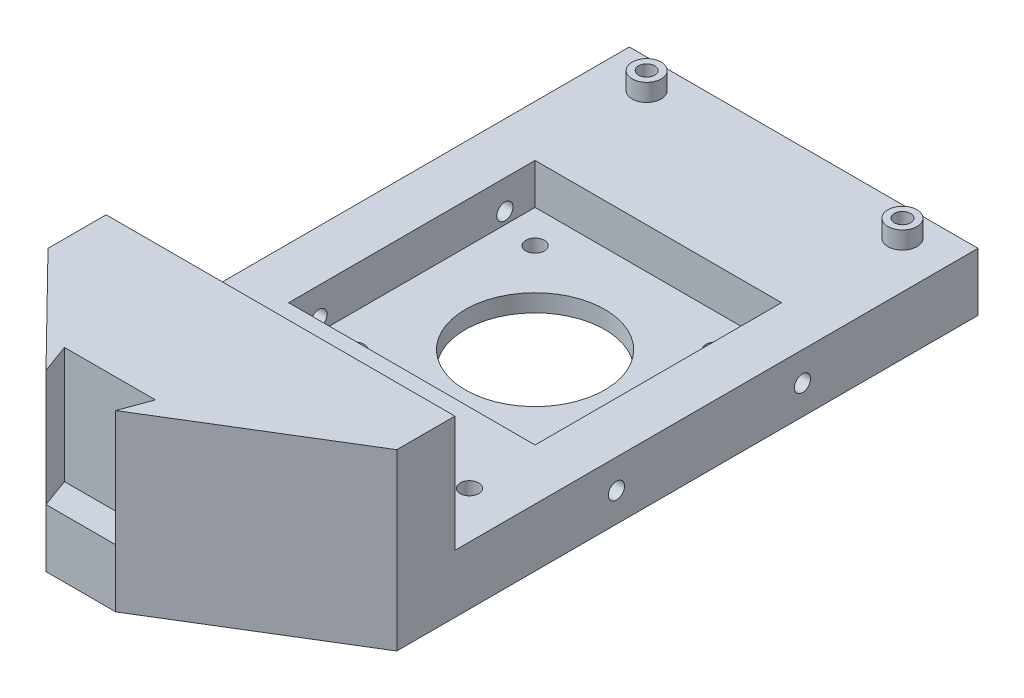
ISO-10303-21;
HEADER;
FILE_DESCRIPTION(('STEP AP214'),'2;1');
FILE_NAME('part.step','',(''),(''),'','','');
FILE_SCHEMA(('AUTOMOTIVE_DESIGN { 1 0 10303 214 1 1 1 1 }'));
ENDSEC;
DATA;
#1=APPLICATION_CONTEXT('core data for automotive mechanical design processes');
#2=APPLICATION_PROTOCOL_DEFINITION('international standard','automotive_design',2000,#1);
#3=PRODUCT_CONTEXT('',#1,'mechanical');
#4=PRODUCT('Part','Part','',(#3));
#5=PRODUCT_RELATED_PRODUCT_CATEGORY('part','',(#4));
#6=PRODUCT_DEFINITION_FORMATION('','',#4);
#7=PRODUCT_DEFINITION_CONTEXT('part definition',#1,'design');
#8=PRODUCT_DEFINITION('design','',#6,#7);
#9=PRODUCT_DEFINITION_SHAPE('','',#8);
#10=(LENGTH_UNIT() NAMED_UNIT(*) SI_UNIT(.MILLI.,.METRE.));
#11=(NAMED_UNIT(*) PLANE_ANGLE_UNIT() SI_UNIT($,.RADIAN.));
#12=(NAMED_UNIT(*) SI_UNIT($,.STERADIAN.) SOLID_ANGLE_UNIT());
#13=UNCERTAINTY_MEASURE_WITH_UNIT(LENGTH_MEASURE(1.E-05),#10,'distance_accuracy_value','');
#14=(GEOMETRIC_REPRESENTATION_CONTEXT(3) GLOBAL_UNCERTAINTY_ASSIGNED_CONTEXT((#13)) GLOBAL_UNIT_ASSIGNED_CONTEXT((#10,
#11,#12)) REPRESENTATION_CONTEXT('',''));
#15=CARTESIAN_POINT('',(0.,0.,0.));
#16=DIRECTION('',(0.,0.,1.));
#17=DIRECTION('',(1.,0.,0.));
#18=AXIS2_PLACEMENT_3D('',#15,#16,#17);
#19=CARTESIAN_POINT('',(4.65691364491559,0.,1.69497795029741));
#20=DIRECTION('',(-0.939692620785908,0.,-0.342020143325671));
#21=DIRECTION('',(-0.342020143325671,0.,0.939692620785908));
#22=AXIS2_PLACEMENT_3D('',#19,#20,#21);
#23=PLANE('',#22);
#24=DIRECTION('',(0.,1.,0.));
#25=VECTOR('',#24,1.);
#26=CARTESIAN_POINT('',(-21.9393136472184,0.,74.7675118781179));
#27=LINE('',#26,#25);
#28=CARTESIAN_POINT('',(-21.9393136472184,10.,74.7675118781179));
#29=VERTEX_POINT('',#28);
#30=CARTESIAN_POINT('',(-21.9393136472184,30.,74.7675118781179));
#31=VERTEX_POINT('',#30);
#32=EDGE_CURVE('E252',#29,#31,#27,.T.);
#33=ORIENTED_EDGE('',*,*,#32,.F.);
#34=DIRECTION('',(-0.342020143325671,0.,0.939692620785907));
#35=VECTOR('',#34,1.);
#36=CARTESIAN_POINT('',(-21.9393136472184,10.,74.7675118781179));
#37=LINE('',#36,#35);
#38=CARTESIAN_POINT('',(-23.7591648185494,10.,79.7675118781179));
#39=VERTEX_POINT('',#38);
#40=EDGE_CURVE('E54',#29,#39,#37,.T.);
#41=ORIENTED_EDGE('',*,*,#40,.T.);
#42=DIRECTION('',(0.,1.,0.));
#43=VECTOR('',#42,1.);
#44=CARTESIAN_POINT('',(-23.7591648185494,0.,79.7675118781179));
#45=LINE('',#44,#43);
#46=CARTESIAN_POINT('',(-23.7591648185494,30.,79.7675118781179));
#47=VERTEX_POINT('',#46);
#48=EDGE_CURVE('E251',#39,#47,#45,.T.);
#49=ORIENTED_EDGE('',*,*,#48,.T.);
#50=DIRECTION('',(-0.342020143325671,0.,0.939692620785908));
#51=VECTOR('',#50,1.);
#52=CARTESIAN_POINT('',(4.65691364491559,30.,1.69497795029741));
#53=LINE('',#52,#51);
#54=EDGE_CURVE('E236',#31,#47,#53,.T.);
#55=ORIENTED_EDGE('',*,*,#54,.F.);
#56=EDGE_LOOP('',(#33,#41,#49,#55));
#57=FACE_BOUND('',#56,.T.);
#58=ADVANCED_FACE('F37',(#57),#23,.T.);
#59=CARTESIAN_POINT('',(-2.65377854905175E-13,0.,74.767511878118));
#60=DIRECTION('',(0.,0.,1.));
#61=DIRECTION('',(1.,0.,0.));
#62=AXIS2_PLACEMENT_3D('',#59,#60,#61);
#63=PLANE('',#62);
#64=DIRECTION('',(0.,1.,0.));
#65=VECTOR('',#64,1.);
#66=CARTESIAN_POINT('',(-37.5790159898804,0.,74.7675118781178));
#67=LINE('',#66,#65);
#68=CARTESIAN_POINT('',(-37.5790159898804,10.,74.7675118781178));
#69=VERTEX_POINT('',#68);
#70=CARTESIAN_POINT('',(-37.5790159898804,30.,74.7675118781178));
#71=VERTEX_POINT('',#70);
#72=EDGE_CURVE('E254',#69,#71,#67,.T.);
#73=ORIENTED_EDGE('',*,*,#72,.F.);
#74=DIRECTION('',(1.,0.,0.));
#75=VECTOR('',#74,1.);
#76=CARTESIAN_POINT('',(-37.5790159898804,10.,74.7675118781178));
#77=LINE('',#76,#75);
#78=EDGE_CURVE('E62',#69,#29,#77,.T.);
#79=ORIENTED_EDGE('',*,*,#78,.T.);
#80=ORIENTED_EDGE('',*,*,#32,.T.);
#81=DIRECTION('',(1.,0.,0.));
#82=VECTOR('',#81,1.);
#83=CARTESIAN_POINT('',(-2.65377854905175E-13,30.,74.767511878118));
#84=LINE('',#83,#82);
#85=EDGE_CURVE('E233',#71,#31,#84,.T.);
#86=ORIENTED_EDGE('',*,*,#85,.F.);
#87=EDGE_LOOP('',(#73,#79,#80,#86));
#88=FACE_BOUND('',#87,.T.);
#89=ADVANCED_FACE('F414',(#88),#63,.T.);
#90=CARTESIAN_POINT('',(-57.2129213045762,0.,20.8238003702799));
#91=DIRECTION('',(0.939692620785911,0.,-0.342020143325662));
#92=DIRECTION('',(-0.342020143325662,0.,-0.939692620785911));
#93=AXIS2_PLACEMENT_3D('',#90,#91,#92);
#94=PLANE('',#93);
#95=DIRECTION('',(0.,1.,0.));
#96=VECTOR('',#95,1.);
#97=CARTESIAN_POINT('',(-35.7591648185494,0.,79.7675118781178));
#98=LINE('',#97,#96);
#99=CARTESIAN_POINT('',(-35.7591648185494,10.,79.7675118781178));
#100=VERTEX_POINT('',#99);
#101=CARTESIAN_POINT('',(-35.7591648185494,30.,79.7675118781178));
#102=VERTEX_POINT('',#101);
#103=EDGE_CURVE('E257',#100,#102,#98,.T.);
#104=ORIENTED_EDGE('',*,*,#103,.F.);
#105=DIRECTION('',(-0.342020143325663,0.,-0.93969262078591));
#106=VECTOR('',#105,1.);
#107=CARTESIAN_POINT('',(-35.7591648185494,10.,79.7675118781178));
#108=LINE('',#107,#106);
#109=EDGE_CURVE('E299',#100,#69,#108,.T.);
#110=ORIENTED_EDGE('',*,*,#109,.T.);
#111=ORIENTED_EDGE('',*,*,#72,.T.);
#112=DIRECTION('',(-0.342020143325662,0.,-0.939692620785911));
#113=VECTOR('',#112,1.);
#114=CARTESIAN_POINT('',(-57.2129213045762,30.,20.8238003702799));
#115=LINE('',#114,#113);
#116=EDGE_CURVE('E230',#102,#71,#115,.T.);
#117=ORIENTED_EDGE('',*,*,#116,.F.);
#118=EDGE_LOOP('',(#104,#110,#111,#117));
#119=FACE_BOUND('',#118,.T.);
#120=ADVANCED_FACE('F419',(#119),#94,.T.);
#121=CARTESIAN_POINT('',(-53.7591648185503,0.,0.));
#122=DIRECTION('',(-1.,0.,0.));
#123=DIRECTION('',(0.,0.,1.));
#124=AXIS2_PLACEMENT_3D('',#121,#122,#123);
#125=PLANE('',#124);
#126=CARTESIAN_POINT('',(-53.7591648185503,5.,-8.3778728914878));
#127=DIRECTION('',(-1.,0.,0.));
#128=DIRECTION('',(0.,0.,1.));
#129=AXIS2_PLACEMENT_3D('',#126,#127,#128);
#130=CIRCLE('',#129,1.39999999999999);
#131=CARTESIAN_POINT('',(-53.7591648185503,5.,-6.97787289148781));
#132=VERTEX_POINT('',#131);
#133=EDGE_CURVE('E318',#132,#132,#130,.T.);
#134=ORIENTED_EDGE('',*,*,#133,.F.);
#135=EDGE_LOOP('',(#134));
#136=FACE_BOUND('',#135,.T.);
#137=CARTESIAN_POINT('',(-53.7591648185503,5.,23.6221271085122));
#138=DIRECTION('',(-1.,0.,0.));
#139=DIRECTION('',(0.,0.,1.));
#140=AXIS2_PLACEMENT_3D('',#137,#138,#139);
#141=CIRCLE('',#140,1.39999999999999);
#142=CARTESIAN_POINT('',(-53.7591648185503,5.,25.0221271085122));
#143=VERTEX_POINT('',#142);
#144=EDGE_CURVE('E324',#143,#143,#141,.T.);
#145=ORIENTED_EDGE('',*,*,#144,.F.);
#146=EDGE_LOOP('',(#145));
#147=FACE_BOUND('',#146,.T.);
#148=DIRECTION('',(0.,1.,0.));
#149=VECTOR('',#148,1.);
#150=CARTESIAN_POINT('',(-53.7591648185502,10.,51.4221271085122));
#151=LINE('',#150,#149);
#152=CARTESIAN_POINT('',(-53.7591648185502,10.,51.4221271085122));
#153=VERTEX_POINT('',#152);
#154=CARTESIAN_POINT('',(-53.7591648185502,30.,51.4221271085122));
#155=VERTEX_POINT('',#154);
#156=EDGE_CURVE('E197',#153,#155,#151,.T.);
#157=ORIENTED_EDGE('',*,*,#156,.F.);
#158=DIRECTION('',(0.,0.,1.));
#159=VECTOR('',#158,1.);
#160=CARTESIAN_POINT('',(-53.7591648185503,10.,-38.5778728914878));
#161=LINE('',#160,#159);
#162=CARTESIAN_POINT('',(-53.7591648185503,10.,-38.5778728914878));
#163=VERTEX_POINT('',#162);
#164=EDGE_CURVE('E189',#163,#153,#161,.T.);
#165=ORIENTED_EDGE('',*,*,#164,.F.);
#166=DIRECTION('',(0.,1.,0.));
#167=VECTOR('',#166,1.);
#168=CARTESIAN_POINT('',(-53.7591648185503,0.,-38.5778728914878));
#169=LINE('',#168,#167);
#170=CARTESIAN_POINT('',(-53.7591648185503,0.,-38.5778728914878));
#171=VERTEX_POINT('',#170);
#172=EDGE_CURVE('E11',#171,#163,#169,.T.);
#173=ORIENTED_EDGE('',*,*,#172,.F.);
#174=DIRECTION('',(0.,0.,1.));
#175=VECTOR('',#174,1.);
#176=CARTESIAN_POINT('',(-53.7591648185503,0.,0.));
#177=LINE('',#176,#175);
#178=CARTESIAN_POINT('',(-53.7591648185502,0.,61.4221271085122));
#179=VERTEX_POINT('',#178);
#180=EDGE_CURVE('E211',#171,#179,#177,.T.);
#181=ORIENTED_EDGE('',*,*,#180,.T.);
#182=DIRECTION('',(0.,1.,0.));
#183=VECTOR('',#182,1.);
#184=CARTESIAN_POINT('',(-53.7591648185502,0.,61.4221271085122));
#185=LINE('',#184,#183);
#186=CARTESIAN_POINT('',(-53.7591648185502,30.,61.4221271085122));
#187=VERTEX_POINT('',#186);
#188=EDGE_CURVE('E41',#179,#187,#185,.T.);
#189=ORIENTED_EDGE('',*,*,#188,.T.);
#190=DIRECTION('',(0.,0.,1.));
#191=VECTOR('',#190,1.);
#192=CARTESIAN_POINT('',(-53.7591648185503,30.,0.));
#193=LINE('',#192,#191);
#194=EDGE_CURVE('E207',#155,#187,#193,.T.);
#195=ORIENTED_EDGE('',*,*,#194,.F.);
#196=EDGE_LOOP('',(#157,#165,#173,#181,#189,#195));
#197=FACE_BOUND('',#196,.T.);
#198=ADVANCED_FACE('F39',(#136,#147,#197),#125,.T.);
#199=CARTESIAN_POINT('',(0.,0.,-38.5778728914878));
#200=DIRECTION('',(0.,0.,-1.));
#201=DIRECTION('',(-1.,0.,0.));
#202=AXIS2_PLACEMENT_3D('',#199,#200,#201);
#203=PLANE('',#202);
#204=DIRECTION('',(-1.,0.,0.));
#205=VECTOR('',#204,1.);
#206=CARTESIAN_POINT('',(6.24083518144976,10.,-38.5778728914878));
#207=LINE('',#206,#205);
#208=CARTESIAN_POINT('',(6.24083518144976,10.,-38.5778728914878));
#209=VERTEX_POINT('',#208);
#210=EDGE_CURVE('E200',#209,#163,#207,.T.);
#211=ORIENTED_EDGE('',*,*,#210,.F.);
#212=DIRECTION('',(0.,1.,0.));
#213=VECTOR('',#212,1.);
#214=CARTESIAN_POINT('',(6.24083518144974,0.,-38.5778728914878));
#215=LINE('',#214,#213);
#216=CARTESIAN_POINT('',(6.24083518144974,0.,-38.5778728914878));
#217=VERTEX_POINT('',#216);
#218=EDGE_CURVE('E46',#217,#209,#215,.T.);
#219=ORIENTED_EDGE('',*,*,#218,.F.);
#220=DIRECTION('',(-1.,0.,0.));
#221=VECTOR('',#220,1.);
#222=CARTESIAN_POINT('',(0.,0.,-38.5778728914878));
#223=LINE('',#222,#221);
#224=EDGE_CURVE('E223',#217,#171,#223,.T.);
#225=ORIENTED_EDGE('',*,*,#224,.T.);
#226=ORIENTED_EDGE('',*,*,#172,.T.);
#227=EDGE_LOOP('',(#211,#219,#225,#226));
#228=FACE_BOUND('',#227,.T.);
#229=ADVANCED_FACE('F283',(#228),#203,.T.);
#230=CARTESIAN_POINT('',(6.24083518144975,0.,0.));
#231=DIRECTION('',(1.,0.,0.));
#232=DIRECTION('',(0.,0.,-1.));
#233=AXIS2_PLACEMENT_3D('',#230,#231,#232);
#234=PLANE('',#233);
#235=CARTESIAN_POINT('',(6.2408351814497,5.,-8.37787289148781));
#236=DIRECTION('',(-1.,0.,0.));
#237=DIRECTION('',(0.,0.,1.));
#238=AXIS2_PLACEMENT_3D('',#235,#236,#237);
#239=CIRCLE('',#238,1.4);
#240=CARTESIAN_POINT('',(6.2408351814497,5.,-6.97787289148781));
#241=VERTEX_POINT('',#240);
#242=EDGE_CURVE('E309',#241,#241,#239,.T.);
#243=ORIENTED_EDGE('',*,*,#242,.T.);
#244=EDGE_LOOP('',(#243));
#245=FACE_BOUND('',#244,.T.);
#246=CARTESIAN_POINT('',(6.2408351814497,5.,23.6221271085122));
#247=DIRECTION('',(-1.,0.,0.));
#248=DIRECTION('',(0.,0.,1.));
#249=AXIS2_PLACEMENT_3D('',#246,#247,#248);
#250=CIRCLE('',#249,1.4);
#251=CARTESIAN_POINT('',(6.2408351814497,5.,25.0221271085122));
#252=VERTEX_POINT('',#251);
#253=EDGE_CURVE('E315',#252,#252,#250,.T.);
#254=ORIENTED_EDGE('',*,*,#253,.T.);
#255=EDGE_LOOP('',(#254));
#256=FACE_BOUND('',#255,.T.);
#257=DIRECTION('',(0.,1.,0.));
#258=VECTOR('',#257,1.);
#259=CARTESIAN_POINT('',(6.24083518144977,10.,51.4221271085122));
#260=LINE('',#259,#258);
#261=CARTESIAN_POINT('',(6.24083518144977,10.,51.4221271085122));
#262=VERTEX_POINT('',#261);
#263=CARTESIAN_POINT('',(6.24083518144977,30.,51.4221271085122));
#264=VERTEX_POINT('',#263);
#265=EDGE_CURVE('E196',#262,#264,#260,.T.);
#266=ORIENTED_EDGE('',*,*,#265,.T.);
#267=DIRECTION('',(0.,0.,-1.));
#268=VECTOR('',#267,1.);
#269=CARTESIAN_POINT('',(6.24083518144975,30.,0.));
#270=LINE('',#269,#268);
#271=CARTESIAN_POINT('',(6.24083518144976,30.,61.4221271085122));
#272=VERTEX_POINT('',#271);
#273=EDGE_CURVE('E215',#272,#264,#270,.T.);
#274=ORIENTED_EDGE('',*,*,#273,.F.);
#275=DIRECTION('',(0.,1.,0.));
#276=VECTOR('',#275,1.);
#277=CARTESIAN_POINT('',(6.24083518144976,0.,61.4221271085122));
#278=LINE('',#277,#276);
#279=CARTESIAN_POINT('',(6.24083518144976,0.,61.4221271085122));
#280=VERTEX_POINT('',#279);
#281=EDGE_CURVE('E246',#280,#272,#278,.T.);
#282=ORIENTED_EDGE('',*,*,#281,.F.);
#283=DIRECTION('',(0.,0.,-1.));
#284=VECTOR('',#283,1.);
#285=CARTESIAN_POINT('',(6.24083518144975,0.,0.));
#286=LINE('',#285,#284);
#287=EDGE_CURVE('E220',#280,#217,#286,.T.);
#288=ORIENTED_EDGE('',*,*,#287,.T.);
#289=ORIENTED_EDGE('',*,*,#218,.T.);
#290=DIRECTION('',(0.,0.,1.));
#291=VECTOR('',#290,1.);
#292=CARTESIAN_POINT('',(6.24083518144976,10.,-38.5778728914878));
#293=LINE('',#292,#291);
#294=EDGE_CURVE('E193',#209,#262,#293,.T.);
#295=ORIENTED_EDGE('',*,*,#294,.T.);
#296=EDGE_LOOP('',(#266,#274,#282,#288,#289,#295));
#297=FACE_BOUND('',#296,.T.);
#298=ADVANCED_FACE('F277',(#245,#256,#297),#234,.T.);
#299=CARTESIAN_POINT('',(29.036155517171,0.,47.4824963583377));
#300=DIRECTION('',(0.521699514082931,0.,0.853129308490591));
#301=DIRECTION('',(0.853129308490591,0.,-0.521699514082931));
#302=AXIS2_PLACEMENT_3D('',#299,#300,#301);
#303=PLANE('',#302);
#304=DIRECTION('',(0.853129308490591,0.,-0.521699514082931));
#305=VECTOR('',#304,1.);
#306=CARTESIAN_POINT('',(29.036155517171,30.,47.4824963583377));
#307=LINE('',#306,#305);
#308=EDGE_CURVE('E239',#47,#272,#307,.T.);
#309=ORIENTED_EDGE('',*,*,#308,.F.);
#310=ORIENTED_EDGE('',*,*,#48,.F.);
#311=CARTESIAN_POINT('',(-23.7591648185494,0.,79.7675118781179));
#312=VERTEX_POINT('',#311);
#313=EDGE_CURVE('E248',#312,#39,#45,.T.);
#314=ORIENTED_EDGE('',*,*,#313,.F.);
#315=DIRECTION('',(0.853129308490591,0.,-0.521699514082931));
#316=VECTOR('',#315,1.);
#317=CARTESIAN_POINT('',(29.036155517171,0.,47.4824963583377));
#318=LINE('',#317,#316);
#319=EDGE_CURVE('E217',#312,#280,#318,.T.);
#320=ORIENTED_EDGE('',*,*,#319,.T.);
#321=ORIENTED_EDGE('',*,*,#281,.T.);
#322=EDGE_LOOP('',(#309,#310,#314,#320,#321));
#323=FACE_BOUND('',#322,.T.);
#324=ADVANCED_FACE('F422',(#323),#303,.T.);
#325=CARTESIAN_POINT('',(-58.0959189845191,0.,57.0021591181852));
#326=DIRECTION('',(-0.713794082879895,0.,0.700355629123983));
#327=DIRECTION('',(0.700355629123983,0.,0.713794082879895));
#328=AXIS2_PLACEMENT_3D('',#325,#326,#327);
#329=PLANE('',#328);
#330=DIRECTION('',(0.700355629123983,0.,0.713794082879895));
#331=VECTOR('',#330,1.);
#332=CARTESIAN_POINT('',(-58.0959189845191,30.,57.0021591181852));
#333=LINE('',#332,#331);
#334=EDGE_CURVE('E227',#187,#102,#333,.T.);
#335=ORIENTED_EDGE('',*,*,#334,.F.);
#336=ORIENTED_EDGE('',*,*,#188,.F.);
#337=DIRECTION('',(0.700355629123983,0.,0.713794082879895));
#338=VECTOR('',#337,1.);
#339=CARTESIAN_POINT('',(-58.0959189845191,0.,57.0021591181852));
#340=LINE('',#339,#338);
#341=CARTESIAN_POINT('',(-35.7591648185494,0.,79.7675118781178));
#342=VERTEX_POINT('',#341);
#343=EDGE_CURVE('E214',#179,#342,#340,.T.);
#344=ORIENTED_EDGE('',*,*,#343,.T.);
#345=EDGE_CURVE('E255',#342,#100,#98,.T.);
#346=ORIENTED_EDGE('',*,*,#345,.T.);
#347=ORIENTED_EDGE('',*,*,#103,.T.);
#348=EDGE_LOOP('',(#335,#336,#344,#346,#347));
#349=FACE_BOUND('',#348,.T.);
#350=ADVANCED_FACE('F269',(#349),#329,.T.);
#351=CARTESIAN_POINT('',(0.,0.,0.));
#352=DIRECTION('',(0.,1.,0.));
#353=DIRECTION('',(0.,0.,1.));
#354=AXIS2_PLACEMENT_3D('',#351,#352,#353);
#355=PLANE('',#354);
#356=ORIENTED_EDGE('',*,*,#319,.F.);
#357=DIRECTION('',(-1.,0.,0.));
#358=VECTOR('',#357,1.);
#359=CARTESIAN_POINT('',(-23.7591648185495,0.,79.7675118781179));
#360=LINE('',#359,#358);
#361=EDGE_CURVE('E292',#312,#342,#360,.T.);
#362=ORIENTED_EDGE('',*,*,#361,.T.);
#363=ORIENTED_EDGE('',*,*,#343,.F.);
#364=ORIENTED_EDGE('',*,*,#180,.F.);
#365=ORIENTED_EDGE('',*,*,#224,.F.);
#366=ORIENTED_EDGE('',*,*,#287,.F.);
#367=EDGE_LOOP('',(#356,#362,#363,#364,#365,#366));
#368=FACE_BOUND('',#367,.T.);
#369=CARTESIAN_POINT('',(-45.7591648185503,0.,40.9221271085122));
#370=DIRECTION('',(0.,1.,0.));
#371=DIRECTION('',(0.,0.,1.));
#372=AXIS2_PLACEMENT_3D('',#369,#370,#371);
#373=CIRCLE('',#372,1.59999999999998);
#374=CARTESIAN_POINT('',(-45.7591648185503,0.,42.5221271085122));
#375=VERTEX_POINT('',#374);
#376=EDGE_CURVE('E333',#375,#375,#373,.T.);
#377=ORIENTED_EDGE('',*,*,#376,.T.);
#378=EDGE_LOOP('',(#377));
#379=FACE_BOUND('',#378,.T.);
#380=CARTESIAN_POINT('',(-1.75916481855024,0.,40.9221271085122));
#381=DIRECTION('',(0.,1.,0.));
#382=DIRECTION('',(0.,0.,1.));
#383=AXIS2_PLACEMENT_3D('',#380,#381,#382);
#384=CIRCLE('',#383,1.59999999999998);
#385=CARTESIAN_POINT('',(-1.75916481855024,0.,42.5221271085122));
#386=VERTEX_POINT('',#385);
#387=EDGE_CURVE('E339',#386,#386,#384,.T.);
#388=ORIENTED_EDGE('',*,*,#387,.T.);
#389=EDGE_LOOP('',(#388));
#390=FACE_BOUND('',#389,.T.);
#391=CARTESIAN_POINT('',(-45.7591648185503,0.,-33.5778728914878));
#392=DIRECTION('',(0.,1.,0.));
#393=DIRECTION('',(0.,0.,1.));
#394=AXIS2_PLACEMENT_3D('',#391,#392,#393);
#395=CIRCLE('',#394,1.4);
#396=CARTESIAN_POINT('',(-45.7591648185503,0.,-32.1778728914878));
#397=VERTEX_POINT('',#396);
#398=EDGE_CURVE('E345',#397,#397,#395,.T.);
#399=ORIENTED_EDGE('',*,*,#398,.T.);
#400=EDGE_LOOP('',(#399));
#401=FACE_BOUND('',#400,.T.);
#402=CARTESIAN_POINT('',(-1.75916481855024,0.,-33.5778728914878));
#403=DIRECTION('',(0.,1.,0.));
#404=DIRECTION('',(0.,0.,1.));
#405=AXIS2_PLACEMENT_3D('',#402,#403,#404);
#406=CIRCLE('',#405,1.4);
#407=CARTESIAN_POINT('',(-1.75916481855024,0.,-32.1778728914878));
#408=VERTEX_POINT('',#407);
#409=EDGE_CURVE('E351',#408,#408,#406,.T.);
#410=ORIENTED_EDGE('',*,*,#409,.T.);
#411=EDGE_LOOP('',(#410));
#412=FACE_BOUND('',#411,.T.);
#413=CARTESIAN_POINT('',(-8.25916481855025,0.,23.1221271085122));
#414=DIRECTION('',(0.,1.,0.));
#415=DIRECTION('',(0.,0.,1.));
#416=AXIS2_PLACEMENT_3D('',#413,#414,#415);
#417=CIRCLE('',#416,1.59999999999998);
#418=CARTESIAN_POINT('',(-8.25916481855025,0.,24.7221271085122));
#419=VERTEX_POINT('',#418);
#420=EDGE_CURVE('E357',#419,#419,#417,.T.);
#421=ORIENTED_EDGE('',*,*,#420,.T.);
#422=EDGE_LOOP('',(#421));
#423=FACE_BOUND('',#422,.T.);
#424=CARTESIAN_POINT('',(-39.2591648185503,0.,-7.8778728914878));
#425=DIRECTION('',(0.,1.,0.));
#426=DIRECTION('',(0.,0.,1.));
#427=AXIS2_PLACEMENT_3D('',#424,#425,#426);
#428=CIRCLE('',#427,1.59999999999998);
#429=CARTESIAN_POINT('',(-39.2591648185503,0.,-6.27787289148782));
#430=VERTEX_POINT('',#429);
#431=EDGE_CURVE('E363',#430,#430,#428,.T.);
#432=ORIENTED_EDGE('',*,*,#431,.T.);
#433=EDGE_LOOP('',(#432));
#434=FACE_BOUND('',#433,.T.);
#435=CARTESIAN_POINT('',(-8.25916481855025,0.,-7.8778728914878));
#436=DIRECTION('',(0.,1.,0.));
#437=DIRECTION('',(0.,0.,1.));
#438=AXIS2_PLACEMENT_3D('',#435,#436,#437);
#439=CIRCLE('',#438,1.59999999999998);
#440=CARTESIAN_POINT('',(-8.25916481855025,0.,-6.27787289148782));
#441=VERTEX_POINT('',#440);
#442=EDGE_CURVE('E369',#441,#441,#439,.T.);
#443=ORIENTED_EDGE('',*,*,#442,.T.);
#444=EDGE_LOOP('',(#443));
#445=FACE_BOUND('',#444,.T.);
#446=CARTESIAN_POINT('',(-39.2591648185503,0.,23.1221271085122));
#447=DIRECTION('',(0.,1.,0.));
#448=DIRECTION('',(0.,0.,1.));
#449=AXIS2_PLACEMENT_3D('',#446,#447,#448);
#450=CIRCLE('',#449,1.59999999999998);
#451=CARTESIAN_POINT('',(-39.2591648185503,0.,24.7221271085122));
#452=VERTEX_POINT('',#451);
#453=EDGE_CURVE('E375',#452,#452,#450,.T.);
#454=ORIENTED_EDGE('',*,*,#453,.T.);
#455=EDGE_LOOP('',(#454));
#456=FACE_BOUND('',#455,.T.);
#457=CARTESIAN_POINT('',(-23.7591648185502,0.,7.6221271085122));
#458=DIRECTION('',(0.,1.,0.));
#459=DIRECTION('',(0.,0.,1.));
#460=AXIS2_PLACEMENT_3D('',#457,#458,#459);
#461=CIRCLE('',#460,12.);
#462=CARTESIAN_POINT('',(-23.7591648185502,0.,19.6221271085122));
#463=VERTEX_POINT('',#462);
#464=EDGE_CURVE('E381',#463,#463,#461,.T.);
#465=ORIENTED_EDGE('',*,*,#464,.T.);
#466=EDGE_LOOP('',(#465));
#467=FACE_BOUND('',#466,.T.);
#468=ADVANCED_FACE('F287',(#368,#379,#390,#401,#412,#423,#434,#445,#456,#467),#355,.F.);
#469=CARTESIAN_POINT('',(0.,30.,0.));
#470=DIRECTION('',(0.,1.,0.));
#471=DIRECTION('',(0.,0.,1.));
#472=AXIS2_PLACEMENT_3D('',#469,#470,#471);
#473=PLANE('',#472);
#474=DIRECTION('',(-1.,0.,0.));
#475=VECTOR('',#474,1.);
#476=CARTESIAN_POINT('',(6.24083518144977,30.,51.4221271085122));
#477=LINE('',#476,#475);
#478=EDGE_CURVE('E204',#264,#155,#477,.T.);
#479=ORIENTED_EDGE('',*,*,#478,.T.);
#480=ORIENTED_EDGE('',*,*,#194,.T.);
#481=ORIENTED_EDGE('',*,*,#334,.T.);
#482=ORIENTED_EDGE('',*,*,#116,.T.);
#483=ORIENTED_EDGE('',*,*,#85,.T.);
#484=ORIENTED_EDGE('',*,*,#54,.T.);
#485=ORIENTED_EDGE('',*,*,#308,.T.);
#486=ORIENTED_EDGE('',*,*,#273,.T.);
#487=EDGE_LOOP('',(#479,#480,#481,#482,#483,#484,#485,#486));
#488=FACE_BOUND('',#487,.T.);
#489=ADVANCED_FACE('F271',(#488),#473,.T.);
#490=CARTESIAN_POINT('',(6.24083518144977,10.,51.4221271085122));
#491=DIRECTION('',(0.,0.,1.));
#492=DIRECTION('',(1.,0.,0.));
#493=AXIS2_PLACEMENT_3D('',#490,#491,#492);
#494=PLANE('',#493);
#495=ORIENTED_EDGE('',*,*,#156,.T.);
#496=ORIENTED_EDGE('',*,*,#478,.F.);
#497=ORIENTED_EDGE('',*,*,#265,.F.);
#498=DIRECTION('',(-1.,0.,0.));
#499=VECTOR('',#498,1.);
#500=CARTESIAN_POINT('',(6.24083518144977,10.,51.4221271085122));
#501=LINE('',#500,#499);
#502=EDGE_CURVE('E208',#262,#153,#501,.T.);
#503=ORIENTED_EDGE('',*,*,#502,.T.);
#504=EDGE_LOOP('',(#495,#496,#497,#503));
#505=FACE_BOUND('',#504,.T.);
#506=ADVANCED_FACE('F275',(#505),#494,.F.);
#507=CARTESIAN_POINT('',(6.24083518144976,10.,-38.5778728914878));
#508=DIRECTION('',(0.,-1.,0.));
#509=DIRECTION('',(0.,0.,-1.));
#510=AXIS2_PLACEMENT_3D('',#507,#508,#509);
#511=PLANE('',#510);
#512=CARTESIAN_POINT('',(-45.7591648185503,10.,40.9221271085122));
#513=DIRECTION('',(0.,1.,0.));
#514=DIRECTION('',(0.,0.,1.));
#515=AXIS2_PLACEMENT_3D('',#512,#513,#514);
#516=CIRCLE('',#515,1.59999999999998);
#517=CARTESIAN_POINT('',(-45.7591648185503,10.,42.5221271085122));
#518=VERTEX_POINT('',#517);
#519=EDGE_CURVE('E330',#518,#518,#516,.T.);
#520=ORIENTED_EDGE('',*,*,#519,.F.);
#521=EDGE_LOOP('',(#520));
#522=FACE_BOUND('',#521,.T.);
#523=CARTESIAN_POINT('',(-1.75916481855024,10.,40.9221271085122));
#524=DIRECTION('',(0.,1.,0.));
#525=DIRECTION('',(0.,0.,1.));
#526=AXIS2_PLACEMENT_3D('',#523,#524,#525);
#527=CIRCLE('',#526,1.59999999999999);
#528=CARTESIAN_POINT('',(-1.75916481855024,10.,42.5221271085122));
#529=VERTEX_POINT('',#528);
#530=EDGE_CURVE('E336',#529,#529,#527,.T.);
#531=ORIENTED_EDGE('',*,*,#530,.F.);
#532=EDGE_LOOP('',(#531));
#533=FACE_BOUND('',#532,.T.);
#534=CARTESIAN_POINT('',(-1.75916481855024,10.,-33.5778728914878));
#535=DIRECTION('',(0.,-1.,0.));
#536=DIRECTION('',(0.,0.,-1.));
#537=AXIS2_PLACEMENT_3D('',#534,#535,#536);
#538=CIRCLE('',#537,2.5);
#539=CARTESIAN_POINT('',(-1.75916481855024,10.,-36.0778728914878));
#540=VERTEX_POINT('',#539);
#541=EDGE_CURVE('E384',#540,#540,#538,.T.);
#542=ORIENTED_EDGE('',*,*,#541,.T.);
#543=EDGE_LOOP('',(#542));
#544=FACE_BOUND('',#543,.T.);
#545=CARTESIAN_POINT('',(-45.7591648185503,10.,-33.5778728914878));
#546=DIRECTION('',(0.,-1.,0.));
#547=DIRECTION('',(0.,0.,-1.));
#548=AXIS2_PLACEMENT_3D('',#545,#546,#547);
#549=CIRCLE('',#548,2.5);
#550=CARTESIAN_POINT('',(-45.7591648185503,10.,-36.0778728914878));
#551=VERTEX_POINT('',#550);
#552=EDGE_CURVE('E389',#551,#551,#549,.T.);
#553=ORIENTED_EDGE('',*,*,#552,.T.);
#554=EDGE_LOOP('',(#553));
#555=FACE_BOUND('',#554,.T.);
#556=DIRECTION('',(1.,0.,0.));
#557=VECTOR('',#556,1.);
#558=CARTESIAN_POINT('',(-44.9591648185502,10.,28.8221271085122));
#559=LINE('',#558,#557);
#560=CARTESIAN_POINT('',(-44.9591648185502,10.,28.8221271085122));
#561=VERTEX_POINT('',#560);
#562=CARTESIAN_POINT('',(-2.55916481855025,10.,28.8221271085122));
#563=VERTEX_POINT('',#562);
#564=EDGE_CURVE('E183',#561,#563,#559,.T.);
#565=ORIENTED_EDGE('',*,*,#564,.F.);
#566=DIRECTION('',(0.,0.,1.));
#567=VECTOR('',#566,1.);
#568=CARTESIAN_POINT('',(-44.9591648185502,10.,-13.5778728914878));
#569=LINE('',#568,#567);
#570=CARTESIAN_POINT('',(-44.9591648185502,10.,-13.5778728914878));
#571=VERTEX_POINT('',#570);
#572=EDGE_CURVE('E154',#571,#561,#569,.T.);
#573=ORIENTED_EDGE('',*,*,#572,.F.);
#574=DIRECTION('',(-1.,0.,0.));
#575=VECTOR('',#574,1.);
#576=CARTESIAN_POINT('',(-2.55916481855025,10.,-13.5778728914878));
#577=LINE('',#576,#575);
#578=CARTESIAN_POINT('',(-2.55916481855025,10.,-13.5778728914878));
#579=VERTEX_POINT('',#578);
#580=EDGE_CURVE('E171',#579,#571,#577,.T.);
#581=ORIENTED_EDGE('',*,*,#580,.F.);
#582=DIRECTION('',(0.,0.,-1.));
#583=VECTOR('',#582,1.);
#584=CARTESIAN_POINT('',(-2.55916481855025,10.,28.8221271085122));
#585=LINE('',#584,#583);
#586=EDGE_CURVE('E174',#563,#579,#585,.T.);
#587=ORIENTED_EDGE('',*,*,#586,.F.);
#588=EDGE_LOOP('',(#565,#573,#581,#587));
#589=FACE_BOUND('',#588,.T.);
#590=ORIENTED_EDGE('',*,*,#164,.T.);
#591=ORIENTED_EDGE('',*,*,#502,.F.);
#592=ORIENTED_EDGE('',*,*,#294,.F.);
#593=ORIENTED_EDGE('',*,*,#210,.T.);
#594=EDGE_LOOP('',(#590,#591,#592,#593));
#595=FACE_BOUND('',#594,.T.);
#596=ADVANCED_FACE('F280',(#522,#533,#544,#555,#589,#595),#511,.F.);
#597=CARTESIAN_POINT('',(-44.9591648185502,3.,-13.5778728914878));
#598=DIRECTION('',(-1.,0.,0.));
#599=DIRECTION('',(0.,0.,1.));
#600=AXIS2_PLACEMENT_3D('',#597,#598,#599);
#601=PLANE('',#600);
#602=CARTESIAN_POINT('',(-44.9591648185502,5.,-8.3778728914878));
#603=DIRECTION('',(-1.,0.,0.));
#604=DIRECTION('',(0.,0.,1.));
#605=AXIS2_PLACEMENT_3D('',#602,#603,#604);
#606=CIRCLE('',#605,1.39999999999999);
#607=CARTESIAN_POINT('',(-44.9591648185502,5.,-6.9778728914878));
#608=VERTEX_POINT('',#607);
#609=EDGE_CURVE('E321',#608,#608,#606,.T.);
#610=ORIENTED_EDGE('',*,*,#609,.T.);
#611=EDGE_LOOP('',(#610));
#612=FACE_BOUND('',#611,.T.);
#613=CARTESIAN_POINT('',(-44.9591648185502,5.,23.6221271085122));
#614=DIRECTION('',(-1.,0.,0.));
#615=DIRECTION('',(0.,0.,1.));
#616=AXIS2_PLACEMENT_3D('',#613,#614,#615);
#617=CIRCLE('',#616,1.39999999999999);
#618=CARTESIAN_POINT('',(-44.9591648185502,5.,25.0221271085122));
#619=VERTEX_POINT('',#618);
#620=EDGE_CURVE('E327',#619,#619,#617,.T.);
#621=ORIENTED_EDGE('',*,*,#620,.T.);
#622=EDGE_LOOP('',(#621));
#623=FACE_BOUND('',#622,.T.);
#624=ORIENTED_EDGE('',*,*,#572,.T.);
#625=DIRECTION('',(0.,1.,0.));
#626=VECTOR('',#625,1.);
#627=CARTESIAN_POINT('',(-44.9591648185502,3.,28.8221271085122));
#628=LINE('',#627,#626);
#629=CARTESIAN_POINT('',(-44.9591648185502,3.,28.8221271085122));
#630=VERTEX_POINT('',#629);
#631=EDGE_CURVE('E147',#630,#561,#628,.T.);
#632=ORIENTED_EDGE('',*,*,#631,.F.);
#633=DIRECTION('',(0.,0.,1.));
#634=VECTOR('',#633,1.);
#635=CARTESIAN_POINT('',(-44.9591648185502,3.,-13.5778728914878));
#636=LINE('',#635,#634);
#637=CARTESIAN_POINT('',(-44.9591648185502,3.,-13.5778728914878));
#638=VERTEX_POINT('',#637);
#639=EDGE_CURVE('E151',#638,#630,#636,.T.);
#640=ORIENTED_EDGE('',*,*,#639,.F.);
#641=DIRECTION('',(0.,1.,0.));
#642=VECTOR('',#641,1.);
#643=CARTESIAN_POINT('',(-44.9591648185502,3.,-13.5778728914878));
#644=LINE('',#643,#642);
#645=EDGE_CURVE('E187',#638,#571,#644,.T.);
#646=ORIENTED_EDGE('',*,*,#645,.T.);
#647=EDGE_LOOP('',(#624,#632,#640,#646));
#648=FACE_BOUND('',#647,.T.);
#649=ADVANCED_FACE('F149',(#612,#623,#648),#601,.F.);
#650=CARTESIAN_POINT('',(-2.55916481855025,3.,-13.5778728914878));
#651=DIRECTION('',(0.,0.,-1.));
#652=DIRECTION('',(0.,1.,0.));
#653=AXIS2_PLACEMENT_3D('',#650,#651,#652);
#654=PLANE('',#653);
#655=ORIENTED_EDGE('',*,*,#580,.T.);
#656=ORIENTED_EDGE('',*,*,#645,.F.);
#657=DIRECTION('',(-1.,0.,0.));
#658=VECTOR('',#657,1.);
#659=CARTESIAN_POINT('',(-2.55916481855025,3.,-13.5778728914878));
#660=LINE('',#659,#658);
#661=CARTESIAN_POINT('',(-2.55916481855025,3.,-13.5778728914878));
#662=VERTEX_POINT('',#661);
#663=EDGE_CURVE('E159',#662,#638,#660,.T.);
#664=ORIENTED_EDGE('',*,*,#663,.F.);
#665=DIRECTION('',(0.,1.,0.));
#666=VECTOR('',#665,1.);
#667=CARTESIAN_POINT('',(-2.55916481855025,3.,-13.5778728914878));
#668=LINE('',#667,#666);
#669=EDGE_CURVE('E190',#662,#579,#668,.T.);
#670=ORIENTED_EDGE('',*,*,#669,.T.);
#671=EDGE_LOOP('',(#655,#656,#664,#670));
#672=FACE_BOUND('',#671,.T.);
#673=ADVANCED_FACE('F520',(#672),#654,.F.);
#674=CARTESIAN_POINT('',(-2.55916481855025,3.,28.8221271085122));
#675=DIRECTION('',(1.,0.,0.));
#676=DIRECTION('',(0.,0.,-1.));
#677=AXIS2_PLACEMENT_3D('',#674,#675,#676);
#678=PLANE('',#677);
#679=CARTESIAN_POINT('',(-2.55916481855025,5.,-8.3778728914878));
#680=DIRECTION('',(-1.,0.,0.));
#681=DIRECTION('',(0.,0.,1.));
#682=AXIS2_PLACEMENT_3D('',#679,#680,#681);
#683=CIRCLE('',#682,1.39999999999999);
#684=CARTESIAN_POINT('',(-2.55916481855025,5.,-6.97787289148782));
#685=VERTEX_POINT('',#684);
#686=EDGE_CURVE('E305',#685,#685,#683,.T.);
#687=ORIENTED_EDGE('',*,*,#686,.F.);
#688=EDGE_LOOP('',(#687));
#689=FACE_BOUND('',#688,.T.);
#690=CARTESIAN_POINT('',(-2.55916481855025,5.,23.6221271085122));
#691=DIRECTION('',(-1.,0.,0.));
#692=DIRECTION('',(0.,0.,1.));
#693=AXIS2_PLACEMENT_3D('',#690,#691,#692);
#694=CIRCLE('',#693,1.39999999999999);
#695=CARTESIAN_POINT('',(-2.55916481855025,5.,25.0221271085122));
#696=VERTEX_POINT('',#695);
#697=EDGE_CURVE('E312',#696,#696,#694,.T.);
#698=ORIENTED_EDGE('',*,*,#697,.F.);
#699=EDGE_LOOP('',(#698));
#700=FACE_BOUND('',#699,.T.);
#701=ORIENTED_EDGE('',*,*,#586,.T.);
#702=ORIENTED_EDGE('',*,*,#669,.F.);
#703=DIRECTION('',(0.,0.,-1.));
#704=VECTOR('',#703,1.);
#705=CARTESIAN_POINT('',(-2.55916481855025,3.,28.8221271085122));
#706=LINE('',#705,#704);
#707=CARTESIAN_POINT('',(-2.55916481855025,3.,28.8221271085122));
#708=VERTEX_POINT('',#707);
#709=EDGE_CURVE('E167',#708,#662,#706,.T.);
#710=ORIENTED_EDGE('',*,*,#709,.F.);
#711=DIRECTION('',(0.,1.,0.));
#712=VECTOR('',#711,1.);
#713=CARTESIAN_POINT('',(-2.55916481855025,3.,28.8221271085122));
#714=LINE('',#713,#712);
#715=EDGE_CURVE('E158',#708,#563,#714,.T.);
#716=ORIENTED_EDGE('',*,*,#715,.T.);
#717=EDGE_LOOP('',(#701,#702,#710,#716));
#718=FACE_BOUND('',#717,.T.);
#719=ADVANCED_FACE('F518',(#689,#700,#718),#678,.F.);
#720=CARTESIAN_POINT('',(-44.9591648185502,3.,28.8221271085122));
#721=DIRECTION('',(0.,0.,1.));
#722=DIRECTION('',(0.,-1.,0.));
#723=AXIS2_PLACEMENT_3D('',#720,#721,#722);
#724=PLANE('',#723);
#725=ORIENTED_EDGE('',*,*,#564,.T.);
#726=ORIENTED_EDGE('',*,*,#715,.F.);
#727=DIRECTION('',(1.,0.,0.));
#728=VECTOR('',#727,1.);
#729=CARTESIAN_POINT('',(-44.9591648185502,3.,28.8221271085122));
#730=LINE('',#729,#728);
#731=EDGE_CURVE('E162',#630,#708,#730,.T.);
#732=ORIENTED_EDGE('',*,*,#731,.F.);
#733=ORIENTED_EDGE('',*,*,#631,.T.);
#734=EDGE_LOOP('',(#725,#726,#732,#733));
#735=FACE_BOUND('',#734,.T.);
#736=ADVANCED_FACE('F163',(#735),#724,.F.);
#737=CARTESIAN_POINT('',(0.,3.,0.));
#738=DIRECTION('',(0.,1.,0.));
#739=DIRECTION('',(0.,0.,1.));
#740=AXIS2_PLACEMENT_3D('',#737,#738,#739);
#741=PLANE('',#740);
#742=CARTESIAN_POINT('',(-8.25916481855025,3.,23.1221271085122));
#743=DIRECTION('',(0.,1.,0.));
#744=DIRECTION('',(0.,0.,1.));
#745=AXIS2_PLACEMENT_3D('',#742,#743,#744);
#746=CIRCLE('',#745,1.59999999999999);
#747=CARTESIAN_POINT('',(-8.25916481855025,3.,24.7221271085122));
#748=VERTEX_POINT('',#747);
#749=EDGE_CURVE('E354',#748,#748,#746,.T.);
#750=ORIENTED_EDGE('',*,*,#749,.F.);
#751=EDGE_LOOP('',(#750));
#752=FACE_BOUND('',#751,.T.);
#753=CARTESIAN_POINT('',(-39.2591648185503,3.,-7.8778728914878));
#754=DIRECTION('',(0.,1.,0.));
#755=DIRECTION('',(0.,0.,1.));
#756=AXIS2_PLACEMENT_3D('',#753,#754,#755);
#757=CIRCLE('',#756,1.59999999999998);
#758=CARTESIAN_POINT('',(-39.2591648185503,3.,-6.27787289148782));
#759=VERTEX_POINT('',#758);
#760=EDGE_CURVE('E360',#759,#759,#757,.T.);
#761=ORIENTED_EDGE('',*,*,#760,.F.);
#762=EDGE_LOOP('',(#761));
#763=FACE_BOUND('',#762,.T.);
#764=CARTESIAN_POINT('',(-8.25916481855025,3.,-7.8778728914878));
#765=DIRECTION('',(0.,1.,0.));
#766=DIRECTION('',(0.,0.,1.));
#767=AXIS2_PLACEMENT_3D('',#764,#765,#766);
#768=CIRCLE('',#767,1.59999999999999);
#769=CARTESIAN_POINT('',(-8.25916481855025,3.,-6.27787289148782));
#770=VERTEX_POINT('',#769);
#771=EDGE_CURVE('E366',#770,#770,#768,.T.);
#772=ORIENTED_EDGE('',*,*,#771,.F.);
#773=EDGE_LOOP('',(#772));
#774=FACE_BOUND('',#773,.T.);
#775=CARTESIAN_POINT('',(-39.2591648185503,3.,23.1221271085122));
#776=DIRECTION('',(0.,1.,0.));
#777=DIRECTION('',(0.,0.,1.));
#778=AXIS2_PLACEMENT_3D('',#775,#776,#777);
#779=CIRCLE('',#778,1.59999999999998);
#780=CARTESIAN_POINT('',(-39.2591648185503,3.,24.7221271085122));
#781=VERTEX_POINT('',#780);
#782=EDGE_CURVE('E372',#781,#781,#779,.T.);
#783=ORIENTED_EDGE('',*,*,#782,.F.);
#784=EDGE_LOOP('',(#783));
#785=FACE_BOUND('',#784,.T.);
#786=CARTESIAN_POINT('',(-23.7591648185502,3.,7.6221271085122));
#787=DIRECTION('',(0.,1.,0.));
#788=DIRECTION('',(0.,0.,1.));
#789=AXIS2_PLACEMENT_3D('',#786,#787,#788);
#790=CIRCLE('',#789,12.);
#791=CARTESIAN_POINT('',(-23.7591648185502,3.,19.6221271085122));
#792=VERTEX_POINT('',#791);
#793=EDGE_CURVE('E378',#792,#792,#790,.T.);
#794=ORIENTED_EDGE('',*,*,#793,.F.);
#795=EDGE_LOOP('',(#794));
#796=FACE_BOUND('',#795,.T.);
#797=ORIENTED_EDGE('',*,*,#639,.T.);
#798=ORIENTED_EDGE('',*,*,#731,.T.);
#799=ORIENTED_EDGE('',*,*,#709,.T.);
#800=ORIENTED_EDGE('',*,*,#663,.T.);
#801=EDGE_LOOP('',(#797,#798,#799,#800));
#802=FACE_BOUND('',#801,.T.);
#803=ADVANCED_FACE('F169',(#752,#763,#774,#785,#796,#802),#741,.T.);
#804=CARTESIAN_POINT('',(-45.7591648185503,13.,-33.5778728914878));
#805=DIRECTION('',(0.,-1.,0.));
#806=DIRECTION('',(0.,0.,-1.));
#807=AXIS2_PLACEMENT_3D('',#804,#805,#806);
#808=CYLINDRICAL_SURFACE('',#807,2.5);
#809=CARTESIAN_POINT('',(-45.7591648185503,13.,-33.5778728914878));
#810=DIRECTION('',(0.,-1.,0.));
#811=DIRECTION('',(0.,0.,-1.));
#812=AXIS2_PLACEMENT_3D('',#809,#810,#811);
#813=CIRCLE('',#812,2.5);
#814=CARTESIAN_POINT('',(-45.7591648185503,13.,-36.0778728914878));
#815=VERTEX_POINT('',#814);
#816=EDGE_CURVE('E177',#815,#815,#813,.T.);
#817=ORIENTED_EDGE('',*,*,#816,.T.);
#818=EDGE_LOOP('',(#817));
#819=FACE_BOUND('',#818,.T.);
#820=ORIENTED_EDGE('',*,*,#552,.F.);
#821=EDGE_LOOP('',(#820));
#822=FACE_BOUND('',#821,.T.);
#823=ADVANCED_FACE('F396',(#819,#822),#808,.T.);
#824=CARTESIAN_POINT('',(-43.2591648185503,13.,-33.5778728914878));
#825=DIRECTION('',(0.,1.,0.));
#826=DIRECTION('',(0.,0.,1.));
#827=AXIS2_PLACEMENT_3D('',#824,#825,#826);
#828=PLANE('',#827);
#829=CARTESIAN_POINT('',(-45.7591648185503,13.,-33.5778728914878));
#830=DIRECTION('',(0.,1.,0.));
#831=DIRECTION('',(0.,0.,1.));
#832=AXIS2_PLACEMENT_3D('',#829,#830,#831);
#833=CIRCLE('',#832,1.39999999999998);
#834=CARTESIAN_POINT('',(-45.7591648185503,13.,-32.1778728914878));
#835=VERTEX_POINT('',#834);
#836=EDGE_CURVE('E342',#835,#835,#833,.T.);
#837=ORIENTED_EDGE('',*,*,#836,.F.);
#838=EDGE_LOOP('',(#837));
#839=FACE_BOUND('',#838,.T.);
#840=ORIENTED_EDGE('',*,*,#816,.F.);
#841=EDGE_LOOP('',(#840));
#842=FACE_BOUND('',#841,.T.);
#843=ADVANCED_FACE('F399',(#839,#842),#828,.T.);
#844=CARTESIAN_POINT('',(-1.75916481855024,13.,-33.5778728914878));
#845=DIRECTION('',(0.,-1.,0.));
#846=DIRECTION('',(0.,0.,-1.));
#847=AXIS2_PLACEMENT_3D('',#844,#845,#846);
#848=CYLINDRICAL_SURFACE('',#847,2.5);
#849=CARTESIAN_POINT('',(-1.75916481855024,13.,-33.5778728914878));
#850=DIRECTION('',(0.,-1.,0.));
#851=DIRECTION('',(0.,0.,-1.));
#852=AXIS2_PLACEMENT_3D('',#849,#850,#851);
#853=CIRCLE('',#852,2.5);
#854=CARTESIAN_POINT('',(-1.75916481855024,13.,-36.0778728914878));
#855=VERTEX_POINT('',#854);
#856=EDGE_CURVE('E387',#855,#855,#853,.T.);
#857=ORIENTED_EDGE('',*,*,#856,.T.);
#858=EDGE_LOOP('',(#857));
#859=FACE_BOUND('',#858,.T.);
#860=ORIENTED_EDGE('',*,*,#541,.F.);
#861=EDGE_LOOP('',(#860));
#862=FACE_BOUND('',#861,.T.);
#863=ADVANCED_FACE('F401',(#859,#862),#848,.T.);
#864=CARTESIAN_POINT('',(0.74083518144976,13.,-33.5778728914878));
#865=DIRECTION('',(0.,1.,0.));
#866=DIRECTION('',(0.,0.,1.));
#867=AXIS2_PLACEMENT_3D('',#864,#865,#866);
#868=PLANE('',#867);
#869=CARTESIAN_POINT('',(-1.75916481855024,13.,-33.5778728914878));
#870=DIRECTION('',(0.,1.,0.));
#871=DIRECTION('',(0.,0.,1.));
#872=AXIS2_PLACEMENT_3D('',#869,#870,#871);
#873=CIRCLE('',#872,1.39999999999999);
#874=CARTESIAN_POINT('',(-1.75916481855024,13.,-32.1778728914878));
#875=VERTEX_POINT('',#874);
#876=EDGE_CURVE('E348',#875,#875,#873,.T.);
#877=ORIENTED_EDGE('',*,*,#876,.F.);
#878=EDGE_LOOP('',(#877));
#879=FACE_BOUND('',#878,.T.);
#880=ORIENTED_EDGE('',*,*,#856,.F.);
#881=EDGE_LOOP('',(#880));
#882=FACE_BOUND('',#881,.T.);
#883=ADVANCED_FACE('F408',(#879,#882),#868,.T.);
#884=CARTESIAN_POINT('',(-23.7591648185502,3.,7.6221271085122));
#885=DIRECTION('',(0.,1.,0.));
#886=DIRECTION('',(0.,0.,1.));
#887=AXIS2_PLACEMENT_3D('',#884,#885,#886);
#888=CYLINDRICAL_SURFACE('',#887,12.);
#889=ORIENTED_EDGE('',*,*,#464,.F.);
#890=EDGE_LOOP('',(#889));
#891=FACE_BOUND('',#890,.T.);
#892=ORIENTED_EDGE('',*,*,#793,.T.);
#893=EDGE_LOOP('',(#892));
#894=FACE_BOUND('',#893,.T.);
#895=ADVANCED_FACE('F496',(#891,#894),#888,.F.);
#896=CARTESIAN_POINT('',(-39.2591648185503,3.,23.1221271085122));
#897=DIRECTION('',(0.,1.,0.));
#898=DIRECTION('',(0.,0.,1.));
#899=AXIS2_PLACEMENT_3D('',#896,#897,#898);
#900=CYLINDRICAL_SURFACE('',#899,1.59999999999998);
#901=ORIENTED_EDGE('',*,*,#453,.F.);
#902=EDGE_LOOP('',(#901));
#903=FACE_BOUND('',#902,.T.);
#904=ORIENTED_EDGE('',*,*,#782,.T.);
#905=EDGE_LOOP('',(#904));
#906=FACE_BOUND('',#905,.T.);
#907=ADVANCED_FACE('F492',(#903,#906),#900,.F.);
#908=CARTESIAN_POINT('',(-8.25916481855025,3.,-7.8778728914878));
#909=DIRECTION('',(0.,1.,0.));
#910=DIRECTION('',(0.,0.,1.));
#911=AXIS2_PLACEMENT_3D('',#908,#909,#910);
#912=CYLINDRICAL_SURFACE('',#911,1.59999999999998);
#913=ORIENTED_EDGE('',*,*,#442,.F.);
#914=EDGE_LOOP('',(#913));
#915=FACE_BOUND('',#914,.T.);
#916=ORIENTED_EDGE('',*,*,#771,.T.);
#917=EDGE_LOOP('',(#916));
#918=FACE_BOUND('',#917,.T.);
#919=ADVANCED_FACE('F488',(#915,#918),#912,.F.);
#920=CARTESIAN_POINT('',(-39.2591648185503,3.,-7.8778728914878));
#921=DIRECTION('',(0.,1.,0.));
#922=DIRECTION('',(0.,0.,1.));
#923=AXIS2_PLACEMENT_3D('',#920,#921,#922);
#924=CYLINDRICAL_SURFACE('',#923,1.59999999999998);
#925=ORIENTED_EDGE('',*,*,#431,.F.);
#926=EDGE_LOOP('',(#925));
#927=FACE_BOUND('',#926,.T.);
#928=ORIENTED_EDGE('',*,*,#760,.T.);
#929=EDGE_LOOP('',(#928));
#930=FACE_BOUND('',#929,.T.);
#931=ADVANCED_FACE('F484',(#927,#930),#924,.F.);
#932=CARTESIAN_POINT('',(-8.25916481855025,3.,23.1221271085122));
#933=DIRECTION('',(0.,1.,0.));
#934=DIRECTION('',(0.,0.,1.));
#935=AXIS2_PLACEMENT_3D('',#932,#933,#934);
#936=CYLINDRICAL_SURFACE('',#935,1.59999999999998);
#937=ORIENTED_EDGE('',*,*,#420,.F.);
#938=EDGE_LOOP('',(#937));
#939=FACE_BOUND('',#938,.T.);
#940=ORIENTED_EDGE('',*,*,#749,.T.);
#941=EDGE_LOOP('',(#940));
#942=FACE_BOUND('',#941,.T.);
#943=ADVANCED_FACE('F480',(#939,#942),#936,.F.);
#944=CARTESIAN_POINT('',(-1.75916481855024,13.,-33.5778728914878));
#945=DIRECTION('',(0.,1.,0.));
#946=DIRECTION('',(0.,0.,1.));
#947=AXIS2_PLACEMENT_3D('',#944,#945,#946);
#948=CYLINDRICAL_SURFACE('',#947,1.39999999999999);
#949=ORIENTED_EDGE('',*,*,#409,.F.);
#950=EDGE_LOOP('',(#949));
#951=FACE_BOUND('',#950,.T.);
#952=ORIENTED_EDGE('',*,*,#876,.T.);
#953=EDGE_LOOP('',(#952));
#954=FACE_BOUND('',#953,.T.);
#955=ADVANCED_FACE('F476',(#951,#954),#948,.F.);
#956=CARTESIAN_POINT('',(-45.7591648185503,13.,-33.5778728914878));
#957=DIRECTION('',(0.,1.,0.));
#958=DIRECTION('',(0.,0.,1.));
#959=AXIS2_PLACEMENT_3D('',#956,#957,#958);
#960=CYLINDRICAL_SURFACE('',#959,1.39999999999999);
#961=ORIENTED_EDGE('',*,*,#398,.F.);
#962=EDGE_LOOP('',(#961));
#963=FACE_BOUND('',#962,.T.);
#964=ORIENTED_EDGE('',*,*,#836,.T.);
#965=EDGE_LOOP('',(#964));
#966=FACE_BOUND('',#965,.T.);
#967=ADVANCED_FACE('F472',(#963,#966),#960,.F.);
#968=CARTESIAN_POINT('',(-1.75916481855024,10.,40.9221271085122));
#969=DIRECTION('',(0.,1.,0.));
#970=DIRECTION('',(0.,0.,1.));
#971=AXIS2_PLACEMENT_3D('',#968,#969,#970);
#972=CYLINDRICAL_SURFACE('',#971,1.59999999999998);
#973=ORIENTED_EDGE('',*,*,#387,.F.);
#974=EDGE_LOOP('',(#973));
#975=FACE_BOUND('',#974,.T.);
#976=ORIENTED_EDGE('',*,*,#530,.T.);
#977=EDGE_LOOP('',(#976));
#978=FACE_BOUND('',#977,.T.);
#979=ADVANCED_FACE('F468',(#975,#978),#972,.F.);
#980=CARTESIAN_POINT('',(-45.7591648185503,10.,40.9221271085122));
#981=DIRECTION('',(0.,1.,0.));
#982=DIRECTION('',(0.,0.,1.));
#983=AXIS2_PLACEMENT_3D('',#980,#981,#982);
#984=CYLINDRICAL_SURFACE('',#983,1.59999999999998);
#985=ORIENTED_EDGE('',*,*,#376,.F.);
#986=EDGE_LOOP('',(#985));
#987=FACE_BOUND('',#986,.T.);
#988=ORIENTED_EDGE('',*,*,#519,.T.);
#989=EDGE_LOOP('',(#988));
#990=FACE_BOUND('',#989,.T.);
#991=ADVANCED_FACE('F464',(#987,#990),#984,.F.);
#992=CARTESIAN_POINT('',(-53.7591648185503,5.,23.6221271085122));
#993=DIRECTION('',(-1.,0.,0.));
#994=DIRECTION('',(0.,0.,1.));
#995=AXIS2_PLACEMENT_3D('',#992,#993,#994);
#996=CYLINDRICAL_SURFACE('',#995,1.39999999999999);
#997=ORIENTED_EDGE('',*,*,#620,.F.);
#998=EDGE_LOOP('',(#997));
#999=FACE_BOUND('',#998,.T.);
#1000=ORIENTED_EDGE('',*,*,#144,.T.);
#1001=EDGE_LOOP('',(#1000));
#1002=FACE_BOUND('',#1001,.T.);
#1003=ADVANCED_FACE('F460',(#999,#1002),#996,.F.);
#1004=CARTESIAN_POINT('',(-53.7591648185503,5.,-8.3778728914878));
#1005=DIRECTION('',(-1.,0.,0.));
#1006=DIRECTION('',(0.,0.,1.));
#1007=AXIS2_PLACEMENT_3D('',#1004,#1005,#1006);
#1008=CYLINDRICAL_SURFACE('',#1007,1.39999999999999);
#1009=ORIENTED_EDGE('',*,*,#609,.F.);
#1010=EDGE_LOOP('',(#1009));
#1011=FACE_BOUND('',#1010,.T.);
#1012=ORIENTED_EDGE('',*,*,#133,.T.);
#1013=EDGE_LOOP('',(#1012));
#1014=FACE_BOUND('',#1013,.T.);
#1015=ADVANCED_FACE('F456',(#1011,#1014),#1008,.F.);
#1016=CARTESIAN_POINT('',(-2.55916481855025,5.,23.6221271085122));
#1017=DIRECTION('',(-1.,0.,0.));
#1018=DIRECTION('',(0.,0.,1.));
#1019=AXIS2_PLACEMENT_3D('',#1016,#1017,#1018);
#1020=CYLINDRICAL_SURFACE('',#1019,1.39999999999999);
#1021=ORIENTED_EDGE('',*,*,#253,.F.);
#1022=EDGE_LOOP('',(#1021));
#1023=FACE_BOUND('',#1022,.T.);
#1024=ORIENTED_EDGE('',*,*,#697,.T.);
#1025=EDGE_LOOP('',(#1024));
#1026=FACE_BOUND('',#1025,.T.);
#1027=ADVANCED_FACE('F452',(#1023,#1026),#1020,.F.);
#1028=CARTESIAN_POINT('',(-2.55916481855025,5.,-8.3778728914878));
#1029=DIRECTION('',(-1.,0.,0.));
#1030=DIRECTION('',(0.,0.,1.));
#1031=AXIS2_PLACEMENT_3D('',#1028,#1029,#1030);
#1032=CYLINDRICAL_SURFACE('',#1031,1.39999999999999);
#1033=ORIENTED_EDGE('',*,*,#242,.F.);
#1034=EDGE_LOOP('',(#1033));
#1035=FACE_BOUND('',#1034,.T.);
#1036=ORIENTED_EDGE('',*,*,#686,.T.);
#1037=EDGE_LOOP('',(#1036));
#1038=FACE_BOUND('',#1037,.T.);
#1039=ADVANCED_FACE('F447',(#1035,#1038),#1032,.F.);
#1040=CARTESIAN_POINT('',(-23.7591648185495,10.,79.7675118781179));
#1041=DIRECTION('',(0.,0.,1.));
#1042=DIRECTION('',(1.,0.,0.));
#1043=AXIS2_PLACEMENT_3D('',#1040,#1041,#1042);
#1044=PLANE('',#1043);
#1045=ORIENTED_EDGE('',*,*,#361,.F.);
#1046=ORIENTED_EDGE('',*,*,#313,.T.);
#1047=DIRECTION('',(-1.,0.,0.));
#1048=VECTOR('',#1047,1.);
#1049=CARTESIAN_POINT('',(-23.7591648185495,10.,79.7675118781179));
#1050=LINE('',#1049,#1048);
#1051=EDGE_CURVE('E297',#39,#100,#1050,.T.);
#1052=ORIENTED_EDGE('',*,*,#1051,.T.);
#1053=ORIENTED_EDGE('',*,*,#345,.F.);
#1054=EDGE_LOOP('',(#1045,#1046,#1052,#1053));
#1055=FACE_BOUND('',#1054,.T.);
#1056=ADVANCED_FACE('F295',(#1055),#1044,.T.);
#1057=CARTESIAN_POINT('',(0.,10.,0.));
#1058=DIRECTION('',(0.,-1.,0.));
#1059=DIRECTION('',(0.,0.,-1.));
#1060=AXIS2_PLACEMENT_3D('',#1057,#1058,#1059);
#1061=PLANE('',#1060);
#1062=ORIENTED_EDGE('',*,*,#1051,.F.);
#1063=ORIENTED_EDGE('',*,*,#40,.F.);
#1064=ORIENTED_EDGE('',*,*,#78,.F.);
#1065=ORIENTED_EDGE('',*,*,#109,.F.);
#1066=EDGE_LOOP('',(#1062,#1063,#1064,#1065));
#1067=FACE_BOUND('',#1066,.T.);
#1068=ADVANCED_FACE('F441',(#1067),#1061,.F.);
#1069=CLOSED_SHELL('',(#58,#89,#120,#198,#229,#298,#324,#350,#468,#489,#506,#596,#649,#673,#719,
#736,#803,#823,#843,#863,#883,#895,#907,#919,#931,#943,#955,#967,#979,#991,#1003,#1015,#1027,
#1039,#1056,#1068));
#1070=MANIFOLD_SOLID_BREP('B2',#1069);
#1071=ADVANCED_BREP_SHAPE_REPRESENTATION('',(#18,#1070),#14);
#1072=SHAPE_DEFINITION_REPRESENTATION(#9,#1071);
ENDSEC;
END-ISO-10303-21;
